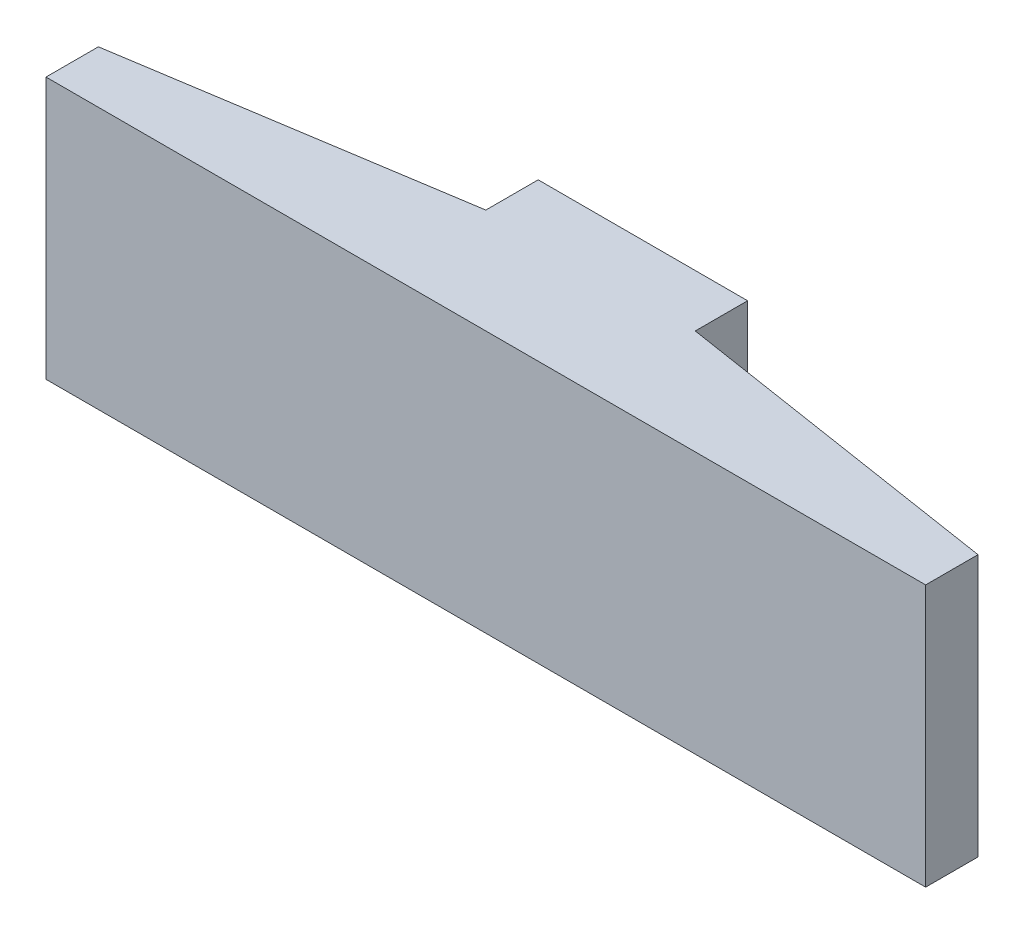
ISO-10303-21;
HEADER;
FILE_DESCRIPTION(('STEP AP214'),'2;1');
FILE_NAME('part.step','',(''),(''),'','','');
FILE_SCHEMA(('AUTOMOTIVE_DESIGN { 1 0 10303 214 1 1 1 1 }'));
ENDSEC;
DATA;
#1=APPLICATION_CONTEXT('core data for automotive mechanical design processes');
#2=APPLICATION_PROTOCOL_DEFINITION('international standard','automotive_design',2000,#1);
#3=PRODUCT_CONTEXT('',#1,'mechanical');
#4=PRODUCT('Part','Part','',(#3));
#5=PRODUCT_RELATED_PRODUCT_CATEGORY('part','',(#4));
#6=PRODUCT_DEFINITION_FORMATION('','',#4);
#7=PRODUCT_DEFINITION_CONTEXT('part definition',#1,'design');
#8=PRODUCT_DEFINITION('design','',#6,#7);
#9=PRODUCT_DEFINITION_SHAPE('','',#8);
#10=(LENGTH_UNIT() NAMED_UNIT(*) SI_UNIT(.MILLI.,.METRE.));
#11=(NAMED_UNIT(*) PLANE_ANGLE_UNIT() SI_UNIT($,.RADIAN.));
#12=(NAMED_UNIT(*) SI_UNIT($,.STERADIAN.) SOLID_ANGLE_UNIT());
#13=UNCERTAINTY_MEASURE_WITH_UNIT(LENGTH_MEASURE(1.E-05),#10,'distance_accuracy_value','');
#14=(GEOMETRIC_REPRESENTATION_CONTEXT(3) GLOBAL_UNCERTAINTY_ASSIGNED_CONTEXT((#13)) GLOBAL_UNIT_ASSIGNED_CONTEXT((#10,
#11,#12)) REPRESENTATION_CONTEXT('',''));
#15=CARTESIAN_POINT('',(0.,0.,0.));
#16=DIRECTION('',(0.,0.,1.));
#17=DIRECTION('',(1.,0.,0.));
#18=AXIS2_PLACEMENT_3D('',#15,#16,#17);
#19=CARTESIAN_POINT('',(1.,2.5,-0.25));
#20=DIRECTION('',(-1.,0.,0.));
#21=DIRECTION('',(0.,0.,1.));
#22=AXIS2_PLACEMENT_3D('',#19,#20,#21);
#23=PLANE('',#22);
#24=DIRECTION('',(0.,0.,-1.));
#25=VECTOR('',#24,1.);
#26=CARTESIAN_POINT('',(1.,0.,-0.25));
#27=LINE('',#26,#25);
#28=CARTESIAN_POINT('',(1.,0.,-0.25));
#29=VERTEX_POINT('',#28);
#30=CARTESIAN_POINT('',(1.,0.,-0.75));
#31=VERTEX_POINT('',#30);
#32=EDGE_CURVE('E132',#29,#31,#27,.T.);
#33=ORIENTED_EDGE('',*,*,#32,.T.);
#34=DIRECTION('',(0.,-1.,0.));
#35=VECTOR('',#34,1.);
#36=CARTESIAN_POINT('',(1.,2.5,-0.75));
#37=LINE('',#36,#35);
#38=CARTESIAN_POINT('',(1.,2.5,-0.75));
#39=VERTEX_POINT('',#38);
#40=EDGE_CURVE('E11',#39,#31,#37,.T.);
#41=ORIENTED_EDGE('',*,*,#40,.F.);
#42=DIRECTION('',(0.,0.,-1.));
#43=VECTOR('',#42,1.);
#44=CARTESIAN_POINT('',(1.,2.5,-0.25));
#45=LINE('',#44,#43);
#46=CARTESIAN_POINT('',(1.,2.5,-0.25));
#47=VERTEX_POINT('',#46);
#48=EDGE_CURVE('E152',#47,#39,#45,.T.);
#49=ORIENTED_EDGE('',*,*,#48,.F.);
#50=DIRECTION('',(0.,-1.,0.));
#51=VECTOR('',#50,1.);
#52=CARTESIAN_POINT('',(1.,2.5,-0.25));
#53=LINE('',#52,#51);
#54=EDGE_CURVE('E49',#47,#29,#53,.T.);
#55=ORIENTED_EDGE('',*,*,#54,.T.);
#56=EDGE_LOOP('',(#33,#41,#49,#55));
#57=FACE_BOUND('',#56,.T.);
#58=ADVANCED_FACE('F33',(#57),#23,.F.);
#59=CARTESIAN_POINT('',(1.,2.5,-0.75));
#60=DIRECTION('',(0.,0.,1.));
#61=DIRECTION('',(1.,0.,0.));
#62=AXIS2_PLACEMENT_3D('',#59,#60,#61);
#63=PLANE('',#62);
#64=DIRECTION('',(-1.,0.,0.));
#65=VECTOR('',#64,1.);
#66=CARTESIAN_POINT('',(1.,0.,-0.75));
#67=LINE('',#66,#65);
#68=CARTESIAN_POINT('',(-1.,0.,-0.75));
#69=VERTEX_POINT('',#68);
#70=EDGE_CURVE('E134',#31,#69,#67,.T.);
#71=ORIENTED_EDGE('',*,*,#70,.T.);
#72=DIRECTION('',(0.,-1.,0.));
#73=VECTOR('',#72,1.);
#74=CARTESIAN_POINT('',(-1.,2.5,-0.75));
#75=LINE('',#74,#73);
#76=CARTESIAN_POINT('',(-1.,2.5,-0.75));
#77=VERTEX_POINT('',#76);
#78=EDGE_CURVE('E41',#77,#69,#75,.T.);
#79=ORIENTED_EDGE('',*,*,#78,.F.);
#80=DIRECTION('',(-1.,0.,0.));
#81=VECTOR('',#80,1.);
#82=CARTESIAN_POINT('',(1.,2.5,-0.75));
#83=LINE('',#82,#81);
#84=EDGE_CURVE('E88',#39,#77,#83,.T.);
#85=ORIENTED_EDGE('',*,*,#84,.F.);
#86=ORIENTED_EDGE('',*,*,#40,.T.);
#87=EDGE_LOOP('',(#71,#79,#85,#86));
#88=FACE_BOUND('',#87,.T.);
#89=ADVANCED_FACE('F165',(#88),#63,.F.);
#90=CARTESIAN_POINT('',(-1.,2.5,-0.25));
#91=DIRECTION('',(-1.,0.,0.));
#92=DIRECTION('',(0.,0.,1.));
#93=AXIS2_PLACEMENT_3D('',#90,#91,#92);
#94=PLANE('',#93);
#95=DIRECTION('',(0.,0.,-1.));
#96=VECTOR('',#95,1.);
#97=CARTESIAN_POINT('',(-1.,0.,-0.25));
#98=LINE('',#97,#96);
#99=CARTESIAN_POINT('',(-1.,0.,-0.25));
#100=VERTEX_POINT('',#99);
#101=EDGE_CURVE('E137',#100,#69,#98,.T.);
#102=ORIENTED_EDGE('',*,*,#101,.F.);
#103=DIRECTION('',(0.,-1.,0.));
#104=VECTOR('',#103,1.);
#105=CARTESIAN_POINT('',(-1.,2.5,-0.25));
#106=LINE('',#105,#104);
#107=CARTESIAN_POINT('',(-1.,2.5,-0.25));
#108=VERTEX_POINT('',#107);
#109=EDGE_CURVE('E158',#108,#100,#106,.T.);
#110=ORIENTED_EDGE('',*,*,#109,.F.);
#111=DIRECTION('',(0.,0.,-1.));
#112=VECTOR('',#111,1.);
#113=CARTESIAN_POINT('',(-1.,2.5,-0.25));
#114=LINE('',#113,#112);
#115=EDGE_CURVE('E164',#108,#77,#114,.T.);
#116=ORIENTED_EDGE('',*,*,#115,.T.);
#117=ORIENTED_EDGE('',*,*,#78,.T.);
#118=EDGE_LOOP('',(#102,#110,#116,#117));
#119=FACE_BOUND('',#118,.T.);
#120=ADVANCED_FACE('F162',(#119),#94,.T.);
#121=CARTESIAN_POINT('',(-4.2,2.5,0.25));
#122=DIRECTION('',(-0.15437688027361,0.,-0.988012033751101));
#123=DIRECTION('',(-0.988012033751101,0.,0.15437688027361));
#124=AXIS2_PLACEMENT_3D('',#121,#122,#123);
#125=PLANE('',#124);
#126=DIRECTION('',(0.988012033751101,0.,-0.15437688027361));
#127=VECTOR('',#126,1.);
#128=CARTESIAN_POINT('',(-4.2,0.,0.25));
#129=LINE('',#128,#127);
#130=CARTESIAN_POINT('',(-4.2,0.,0.25));
#131=VERTEX_POINT('',#130);
#132=EDGE_CURVE('E140',#131,#100,#129,.T.);
#133=ORIENTED_EDGE('',*,*,#132,.F.);
#134=DIRECTION('',(0.,-1.,0.));
#135=VECTOR('',#134,1.);
#136=CARTESIAN_POINT('',(-4.2,2.5,0.25));
#137=LINE('',#136,#135);
#138=CARTESIAN_POINT('',(-4.2,2.5,0.25));
#139=VERTEX_POINT('',#138);
#140=EDGE_CURVE('E156',#139,#131,#137,.T.);
#141=ORIENTED_EDGE('',*,*,#140,.F.);
#142=DIRECTION('',(0.988012033751101,0.,-0.15437688027361));
#143=VECTOR('',#142,1.);
#144=CARTESIAN_POINT('',(-4.2,2.5,0.25));
#145=LINE('',#144,#143);
#146=EDGE_CURVE('E127',#139,#108,#145,.T.);
#147=ORIENTED_EDGE('',*,*,#146,.T.);
#148=ORIENTED_EDGE('',*,*,#109,.T.);
#149=EDGE_LOOP('',(#133,#141,#147,#148));
#150=FACE_BOUND('',#149,.T.);
#151=ADVANCED_FACE('F172',(#150),#125,.T.);
#152=CARTESIAN_POINT('',(-4.2,2.5,0.750000000000001));
#153=DIRECTION('',(-1.,0.,0.));
#154=DIRECTION('',(0.,0.,1.));
#155=AXIS2_PLACEMENT_3D('',#152,#153,#154);
#156=PLANE('',#155);
#157=DIRECTION('',(0.,0.,-1.));
#158=VECTOR('',#157,1.);
#159=CARTESIAN_POINT('',(-4.2,0.,0.750000000000001));
#160=LINE('',#159,#158);
#161=CARTESIAN_POINT('',(-4.2,0.,0.750000000000001));
#162=VERTEX_POINT('',#161);
#163=EDGE_CURVE('E143',#162,#131,#160,.T.);
#164=ORIENTED_EDGE('',*,*,#163,.F.);
#165=DIRECTION('',(0.,-1.,0.));
#166=VECTOR('',#165,1.);
#167=CARTESIAN_POINT('',(-4.2,2.5,0.750000000000001));
#168=LINE('',#167,#166);
#169=CARTESIAN_POINT('',(-4.2,2.5,0.750000000000001));
#170=VERTEX_POINT('',#169);
#171=EDGE_CURVE('E113',#170,#162,#168,.T.);
#172=ORIENTED_EDGE('',*,*,#171,.F.);
#173=DIRECTION('',(0.,0.,-1.));
#174=VECTOR('',#173,1.);
#175=CARTESIAN_POINT('',(-4.2,2.5,0.750000000000001));
#176=LINE('',#175,#174);
#177=EDGE_CURVE('E125',#170,#139,#176,.T.);
#178=ORIENTED_EDGE('',*,*,#177,.T.);
#179=ORIENTED_EDGE('',*,*,#140,.T.);
#180=EDGE_LOOP('',(#164,#172,#178,#179));
#181=FACE_BOUND('',#180,.T.);
#182=ADVANCED_FACE('F198',(#181),#156,.T.);
#183=CARTESIAN_POINT('',(4.2,2.5,0.75));
#184=DIRECTION('',(0.,0.,1.));
#185=DIRECTION('',(1.,0.,0.));
#186=AXIS2_PLACEMENT_3D('',#183,#184,#185);
#187=PLANE('',#186);
#188=DIRECTION('',(-1.,0.,0.));
#189=VECTOR('',#188,1.);
#190=CARTESIAN_POINT('',(4.2,0.,0.75));
#191=LINE('',#190,#189);
#192=CARTESIAN_POINT('',(4.2,0.,0.75));
#193=VERTEX_POINT('',#192);
#194=EDGE_CURVE('E110',#193,#162,#191,.T.);
#195=ORIENTED_EDGE('',*,*,#194,.F.);
#196=DIRECTION('',(0.,-1.,0.));
#197=VECTOR('',#196,1.);
#198=CARTESIAN_POINT('',(4.2,2.5,0.75));
#199=LINE('',#198,#197);
#200=CARTESIAN_POINT('',(4.2,2.5,0.75));
#201=VERTEX_POINT('',#200);
#202=EDGE_CURVE('E104',#201,#193,#199,.T.);
#203=ORIENTED_EDGE('',*,*,#202,.F.);
#204=DIRECTION('',(-1.,0.,0.));
#205=VECTOR('',#204,1.);
#206=CARTESIAN_POINT('',(4.2,2.5,0.75));
#207=LINE('',#206,#205);
#208=EDGE_CURVE('E108',#201,#170,#207,.T.);
#209=ORIENTED_EDGE('',*,*,#208,.T.);
#210=ORIENTED_EDGE('',*,*,#171,.T.);
#211=EDGE_LOOP('',(#195,#203,#209,#210));
#212=FACE_BOUND('',#211,.T.);
#213=ADVANCED_FACE('F106',(#212),#187,.T.);
#214=CARTESIAN_POINT('',(4.2,2.5,0.75));
#215=DIRECTION('',(-1.,0.,0.));
#216=DIRECTION('',(0.,0.,1.));
#217=AXIS2_PLACEMENT_3D('',#214,#215,#216);
#218=PLANE('',#217);
#219=DIRECTION('',(0.,0.,-1.));
#220=VECTOR('',#219,1.);
#221=CARTESIAN_POINT('',(4.2,0.,0.75));
#222=LINE('',#221,#220);
#223=CARTESIAN_POINT('',(4.2,0.,0.249999999999999));
#224=VERTEX_POINT('',#223);
#225=EDGE_CURVE('E147',#193,#224,#222,.T.);
#226=ORIENTED_EDGE('',*,*,#225,.T.);
#227=DIRECTION('',(0.,-1.,0.));
#228=VECTOR('',#227,1.);
#229=CARTESIAN_POINT('',(4.2,2.5,0.249999999999999));
#230=LINE('',#229,#228);
#231=CARTESIAN_POINT('',(4.2,2.5,0.249999999999999));
#232=VERTEX_POINT('',#231);
#233=EDGE_CURVE('E76',#232,#224,#230,.T.);
#234=ORIENTED_EDGE('',*,*,#233,.F.);
#235=DIRECTION('',(0.,0.,-1.));
#236=VECTOR('',#235,1.);
#237=CARTESIAN_POINT('',(4.2,2.5,0.75));
#238=LINE('',#237,#236);
#239=EDGE_CURVE('E115',#201,#232,#238,.T.);
#240=ORIENTED_EDGE('',*,*,#239,.F.);
#241=ORIENTED_EDGE('',*,*,#202,.T.);
#242=EDGE_LOOP('',(#226,#234,#240,#241));
#243=FACE_BOUND('',#242,.T.);
#244=ADVANCED_FACE('F116',(#243),#218,.F.);
#245=CARTESIAN_POINT('',(1.,2.5,-0.25));
#246=DIRECTION('',(0.154376880273609,0.,-0.988012033751101));
#247=DIRECTION('',(-0.988012033751101,0.,-0.154376880273609));
#248=AXIS2_PLACEMENT_3D('',#245,#246,#247);
#249=PLANE('',#248);
#250=DIRECTION('',(0.988012033751102,0.,0.154376880273609));
#251=VECTOR('',#250,1.);
#252=CARTESIAN_POINT('',(1.,0.,-0.25));
#253=LINE('',#252,#251);
#254=EDGE_CURVE('E149',#29,#224,#253,.T.);
#255=ORIENTED_EDGE('',*,*,#254,.F.);
#256=ORIENTED_EDGE('',*,*,#54,.F.);
#257=DIRECTION('',(0.988012033751102,0.,0.154376880273609));
#258=VECTOR('',#257,1.);
#259=CARTESIAN_POINT('',(1.,2.5,-0.25));
#260=LINE('',#259,#258);
#261=EDGE_CURVE('E119',#47,#232,#260,.T.);
#262=ORIENTED_EDGE('',*,*,#261,.T.);
#263=ORIENTED_EDGE('',*,*,#233,.T.);
#264=EDGE_LOOP('',(#255,#256,#262,#263));
#265=FACE_BOUND('',#264,.T.);
#266=ADVANCED_FACE('F177',(#265),#249,.T.);
#267=CARTESIAN_POINT('',(0.,2.5,0.));
#268=DIRECTION('',(0.,1.,0.));
#269=DIRECTION('',(0.,0.,1.));
#270=AXIS2_PLACEMENT_3D('',#267,#268,#269);
#271=PLANE('',#270);
#272=ORIENTED_EDGE('',*,*,#48,.T.);
#273=ORIENTED_EDGE('',*,*,#84,.T.);
#274=ORIENTED_EDGE('',*,*,#115,.F.);
#275=ORIENTED_EDGE('',*,*,#146,.F.);
#276=ORIENTED_EDGE('',*,*,#177,.F.);
#277=ORIENTED_EDGE('',*,*,#208,.F.);
#278=ORIENTED_EDGE('',*,*,#239,.T.);
#279=ORIENTED_EDGE('',*,*,#261,.F.);
#280=EDGE_LOOP('',(#272,#273,#274,#275,#276,#277,#278,#279));
#281=FACE_BOUND('',#280,.T.);
#282=ADVANCED_FACE('F122',(#281),#271,.T.);
#283=CARTESIAN_POINT('',(0.,0.,0.));
#284=DIRECTION('',(0.,1.,0.));
#285=DIRECTION('',(0.,0.,1.));
#286=AXIS2_PLACEMENT_3D('',#283,#284,#285);
#287=PLANE('',#286);
#288=ORIENTED_EDGE('',*,*,#32,.F.);
#289=ORIENTED_EDGE('',*,*,#254,.T.);
#290=ORIENTED_EDGE('',*,*,#225,.F.);
#291=ORIENTED_EDGE('',*,*,#194,.T.);
#292=ORIENTED_EDGE('',*,*,#163,.T.);
#293=ORIENTED_EDGE('',*,*,#132,.T.);
#294=ORIENTED_EDGE('',*,*,#101,.T.);
#295=ORIENTED_EDGE('',*,*,#70,.F.);
#296=EDGE_LOOP('',(#288,#289,#290,#291,#292,#293,#294,#295));
#297=FACE_BOUND('',#296,.T.);
#298=ADVANCED_FACE('F168',(#297),#287,.F.);
#299=CLOSED_SHELL('',(#58,#89,#120,#151,#182,#213,#244,#266,#282,#298));
#300=MANIFOLD_SOLID_BREP('B2',#299);
#301=ADVANCED_BREP_SHAPE_REPRESENTATION('',(#18,#300),#14);
#302=SHAPE_DEFINITION_REPRESENTATION(#9,#301);
ENDSEC;
END-ISO-10303-21;
